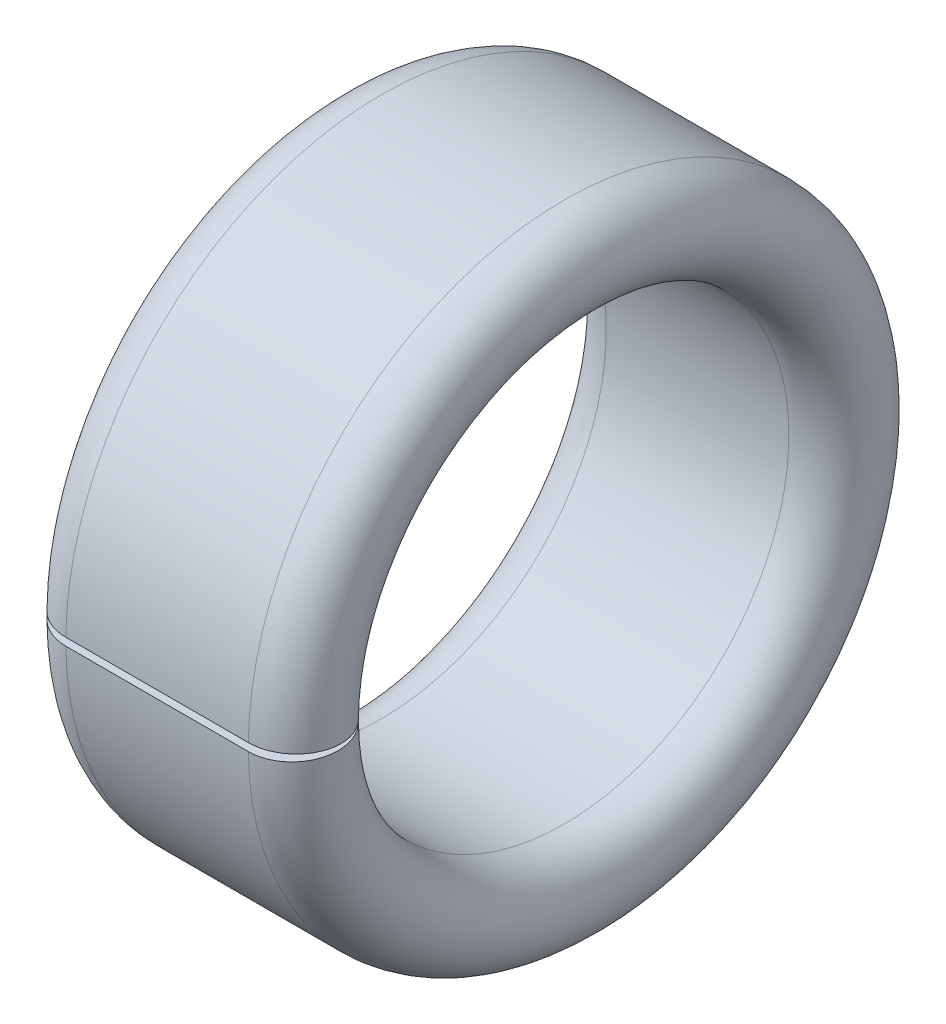
ISO-10303-21;
HEADER;
FILE_DESCRIPTION(('STEP AP214'),'2;1');
FILE_NAME('part.step','',(''),(''),'','','');
FILE_SCHEMA(('AUTOMOTIVE_DESIGN { 1 0 10303 214 1 1 1 1 }'));
ENDSEC;
DATA;
#1=APPLICATION_CONTEXT('core data for automotive mechanical design processes');
#2=APPLICATION_PROTOCOL_DEFINITION('international standard','automotive_design',2000,#1);
#3=PRODUCT_CONTEXT('',#1,'mechanical');
#4=PRODUCT('Part','Part','',(#3));
#5=PRODUCT_RELATED_PRODUCT_CATEGORY('part','',(#4));
#6=PRODUCT_DEFINITION_FORMATION('','',#4);
#7=PRODUCT_DEFINITION_CONTEXT('part definition',#1,'design');
#8=PRODUCT_DEFINITION('design','',#6,#7);
#9=PRODUCT_DEFINITION_SHAPE('','',#8);
#10=(LENGTH_UNIT() NAMED_UNIT(*) SI_UNIT(.MILLI.,.METRE.));
#11=(NAMED_UNIT(*) PLANE_ANGLE_UNIT() SI_UNIT($,.RADIAN.));
#12=(NAMED_UNIT(*) SI_UNIT($,.STERADIAN.) SOLID_ANGLE_UNIT());
#13=UNCERTAINTY_MEASURE_WITH_UNIT(LENGTH_MEASURE(1.E-05),#10,'distance_accuracy_value','');
#14=(GEOMETRIC_REPRESENTATION_CONTEXT(3) GLOBAL_UNCERTAINTY_ASSIGNED_CONTEXT((#13)) GLOBAL_UNIT_ASSIGNED_CONTEXT((#10,
#11,#12)) REPRESENTATION_CONTEXT('',''));
#15=CARTESIAN_POINT('',(0.,0.,0.));
#16=DIRECTION('',(0.,0.,1.));
#17=DIRECTION('',(1.,0.,0.));
#18=AXIS2_PLACEMENT_3D('',#15,#16,#17);
#19=CARTESIAN_POINT('',(0.65,0.,0.));
#20=DIRECTION('',(1.,0.,0.));
#21=DIRECTION('',(0.,0.,-1.));
#22=AXIS2_PLACEMENT_3D('',#19,#20,#21);
#23=TOROIDAL_SURFACE('',#22,3.85,0.65);
#24=CARTESIAN_POINT('',(0.65,0.,0.));
#25=DIRECTION('',(1.,0.,0.));
#26=DIRECTION('',(0.,0.,-1.));
#27=AXIS2_PLACEMENT_3D('',#24,#25,#26);
#28=CIRCLE('',#27,4.5);
#29=CARTESIAN_POINT('',(0.65,-0.0553856430950502,4.49965914603973));
#30=VERTEX_POINT('',#29);
#31=CARTESIAN_POINT('',(0.65,0.0553856430950502,4.49965914603973));
#32=VERTEX_POINT('',#31);
#33=EDGE_CURVE('E82',#30,#32,#28,.T.);
#34=ORIENTED_EDGE('',*,*,#33,.F.);
#35=CARTESIAN_POINT('',(0.6502,-0.0553856420209452,4.49965911528138));
#36=CARTESIAN_POINT('',(0.613640162422909,-0.055387119586004,4.49970142720865));
#37=CARTESIAN_POINT('',(0.577088677921126,-0.0552788167418289,4.49660003953159));
#38=CARTESIAN_POINT('',(0.505044103708183,-0.0548506355577275,4.48433853469269));
#39=CARTESIAN_POINT('',(0.469550252791472,-0.0545309134232436,4.47518289066945));
#40=CARTESIAN_POINT('',(0.400589747790562,-0.0536876631780832,4.45103536306816));
#41=CARTESIAN_POINT('',(0.36712403798953,-0.0531640409632323,4.43604078469912));
#42=CARTESIAN_POINT('',(0.303192172996343,-0.0519283420886692,4.40065499874572));
#43=CARTESIAN_POINT('',(0.272725435014397,-0.0512163021437378,4.38026484253511));
#44=CARTESIAN_POINT('',(0.215644954925809,-0.0496237529747948,4.33466020116776));
#45=CARTESIAN_POINT('',(0.189031692847762,-0.0487432227935688,4.30944511587492));
#46=CARTESIAN_POINT('',(0.140413351325206,-0.0468386332505849,4.25490480732204));
#47=CARTESIAN_POINT('',(0.118408978325227,-0.0458145519255916,4.22557895511723));
#48=CARTESIAN_POINT('',(0.0796332498518353,-0.0436518112032507,4.163646164007));
#49=CARTESIAN_POINT('',(0.0628629529253525,-0.0425131286902977,4.13103856315725));
#50=CARTESIAN_POINT('',(0.0350373536832326,-0.0401537606051438,4.06347510108316));
#51=CARTESIAN_POINT('',(0.0239816948781159,-0.0389330801534921,4.02851938649216));
#52=CARTESIAN_POINT('',(0.00789410530251395,-0.0364438974722856,3.95723852076568));
#53=CARTESIAN_POINT('',(0.00286403596881808,-0.0351753805897738,3.92091295002442));
#54=CARTESIAN_POINT('',(-0.0010240699316397,-0.0326268483335054,3.84793253483424));
#55=CARTESIAN_POINT('',(0.00011804505937394,-0.0313468326781673,3.81127768232188));
#56=CARTESIAN_POINT('',(0.0085428583780061,-0.0288113739353882,3.73867164357527));
#57=CARTESIAN_POINT('',(0.0158268848957219,-0.0275559362230247,3.70272061126311));
#58=CARTESIAN_POINT('',(0.036330574452303,-0.0251055569656707,3.63255093021031));
#59=CARTESIAN_POINT('',(0.0495502222199795,-0.0239106152650446,3.59833227701287));
#60=CARTESIAN_POINT('',(0.0815514669750036,-0.0216150695499982,3.53259644849429));
#61=CARTESIAN_POINT('',(0.100333448905885,-0.0205144720715067,3.50107946033767));
#62=CARTESIAN_POINT('',(0.142925512580246,-0.0184390296690061,3.44164656602556));
#63=CARTESIAN_POINT('',(0.166735344911612,-0.0174641785110735,3.41373048135385));
#64=CARTESIAN_POINT('',(0.218698906057042,-0.0156681959742428,3.36230027053748));
#65=CARTESIAN_POINT('',(0.246851104971362,-0.0148470106805369,3.33878460047471));
#66=CARTESIAN_POINT('',(0.306717436336067,-0.0133810770953265,3.29680575503269));
#67=CARTESIAN_POINT('',(0.338432684757236,-0.0127363843009517,3.2783441688833));
#68=CARTESIAN_POINT('',(0.40451944461703,-0.0116419952832396,3.24700496778206));
#69=CARTESIAN_POINT('',(0.438891433380063,-0.0111923341967547,3.23412835901801));
#70=CARTESIAN_POINT('',(0.50926858003697,-0.0105017485769737,3.21435257429642));
#71=CARTESIAN_POINT('',(0.545271158047522,-0.0102605056490644,3.2074442807101));
#72=CARTESIAN_POINT('',(0.604376485711192,-0.0100416917430007,3.20117827027423));
#73=CARTESIAN_POINT('',(0.627294426364059,-0.00999941069339538,3.19996749942867));
#74=CARTESIAN_POINT('',(0.6502,-0.0100000010743731,3.19998440572788));
#75=B_SPLINE_CURVE_WITH_KNOTS('',3,(#35,#36,#37,#38,#39,#40,#41,#42,#43,#44,#45,#46,#47,#48,#49,
#50,#51,#52,#53,#54,#55,#56,#57,#58,#59,#60,#61,#62,#63,#64,#65,#66,#67,#68,#69,#70,#71,#72,#73,
#74),.UNSPECIFIED.,.F.,.F.,(4,2,2,2,2,2,2,2,2,2,2,2,2,2,2,2,2,2,2,4),(0.,0.109533761042633,
0.218986684234871,0.328490182237423,0.437972358254189,0.547468160785272,0.656980734428369,
0.766515441718591,0.876043315210432,0.985605015547004,1.09516940617961,1.20475749622082,
1.31434530431498,1.42394069824968,1.53353065685953,1.6430820926293,1.75266793680262,
1.86227351573547,1.97171135568883,2.0404275689759),.UNSPECIFIED.);
#76=CARTESIAN_POINT('',(0.65,-0.00999999999999988,3.19998437496185));
#77=VERTEX_POINT('',#76);
#78=EDGE_CURVE('E61',#30,#77,#75,.T.);
#79=ORIENTED_EDGE('',*,*,#78,.T.);
#80=CARTESIAN_POINT('',(0.65,0.,0.));
#81=DIRECTION('',(1.,0.,0.));
#82=DIRECTION('',(0.,0.,-1.));
#83=AXIS2_PLACEMENT_3D('',#80,#81,#82);
#84=CIRCLE('',#83,3.2);
#85=CARTESIAN_POINT('',(0.65,0.00999999999999986,3.19998437496185));
#86=VERTEX_POINT('',#85);
#87=EDGE_CURVE('E84',#77,#86,#84,.T.);
#88=ORIENTED_EDGE('',*,*,#87,.T.);
#89=CARTESIAN_POINT('',(0.6502,0.0100000010743731,3.19998440572788));
#90=CARTESIAN_POINT('',(0.613645692930617,0.00999852146235721,3.19994203518343));
#91=CARTESIAN_POINT('',(0.577099820827778,0.01010682043665,3.20304331204156));
#92=CARTESIAN_POINT('',(0.505066791390805,0.0105349717149683,3.21530396049089));
#93=CARTESIAN_POINT('',(0.469578863077438,0.010854665820221,3.22445880186196));
#94=CARTESIAN_POINT('',(0.400630084367355,0.0116978180757726,3.24860352340799));
#95=CARTESIAN_POINT('',(0.367170170668221,0.0122213695670951,3.26359607652015));
#96=CARTESIAN_POINT('',(0.303248870077235,0.0134568665655181,3.29897608149728));
#97=CARTESIAN_POINT('',(0.272786909859248,0.0141687759547852,3.31936249908281));
#98=CARTESIAN_POINT('',(0.215709968981946,0.0157611099980182,3.36496098005584));
#99=CARTESIAN_POINT('',(0.189096029403005,0.0166415801068325,3.39017434509989));
#100=CARTESIAN_POINT('',(0.140474944579481,0.0185460249204647,3.44471050914639));
#101=CARTESIAN_POINT('',(0.118468509232525,0.0195700216985263,3.47403394024385));
#102=CARTESIAN_POINT('',(0.0796827843469036,0.0217328066067737,3.5359679966729));
#103=CARTESIAN_POINT('',(0.0629056429049683,0.02287164165682,3.56857996561348));
#104=CARTESIAN_POINT('',(0.0350669831524344,0.0252313513806475,3.63615321093917));
#105=CARTESIAN_POINT('',(0.024005110723114,0.0264522209662614,3.67111434161821));
#106=CARTESIAN_POINT('',(0.00790613882833748,0.0289418502069074,3.74240799513391));
#107=CARTESIAN_POINT('',(0.00287105593037289,0.0302106257449016,3.77874097279908));
#108=CARTESIAN_POINT('',(-0.00102464317487148,0.0327597003051775,3.85173691754417));
#109=CARTESIAN_POINT('',(0.000114886627742614,0.0340399995992446,3.88839989240702));
#110=CARTESIAN_POINT('',(0.00853701899218194,0.036575806461535,3.96101589999212));
#111=CARTESIAN_POINT('',(0.0158198941740041,0.0378313129270095,3.99696890113578));
#112=CARTESIAN_POINT('',(0.0363229468121633,0.040281817447814,4.06714216926447));
#113=CARTESIAN_POINT('',(0.0495431008473879,0.0414768157418133,4.10136244308409));
#114=CARTESIAN_POINT('',(0.08154372960915,0.0437721957509364,4.16709352640588));
#115=CARTESIAN_POINT('',(0.100323411337856,0.0448725909311577,4.198604721498));
#116=CARTESIAN_POINT('',(0.142910252219497,0.0469476346621698,4.25802619935238));
#117=CARTESIAN_POINT('',(0.166717159172307,0.0479222895170085,4.28593666263897));
#118=CARTESIAN_POINT('',(0.218672408948953,0.0497178429356373,4.33735458511783));
#119=CARTESIAN_POINT('',(0.246818960159905,0.0505388046430055,4.3608638525056));
#120=CARTESIAN_POINT('',(0.306672475946114,0.0520043565785012,4.40283176892972));
#121=CARTESIAN_POINT('',(0.338380557845351,0.052648891238724,4.42128882670948));
#122=CARTESIAN_POINT('',(0.40445673468139,0.0537431490659153,4.45262427100574));
#123=CARTESIAN_POINT('',(0.438825711104159,0.0541928073470635,4.46550079943546));
#124=CARTESIAN_POINT('',(0.509196611815403,0.0548834587393044,4.48527846763387));
#125=CARTESIAN_POINT('',(0.545195961881649,0.0551247695018203,4.49218870374917));
#126=CARTESIAN_POINT('',(0.60432410085322,0.0553438654646084,4.49846279123284));
#127=CARTESIAN_POINT('',(0.627268237460093,0.0553862326845504,4.49967602967399));
#128=CARTESIAN_POINT('',(0.6502,0.0553856420209452,4.49965911528138));
#129=B_SPLINE_CURVE_WITH_KNOTS('',3,(#89,#90,#91,#92,#93,#94,#95,#96,#97,#98,#99,#100,#101,#102,
#103,#104,#105,#106,#107,#108,#109,#110,#111,#112,#113,#114,#115,#116,#117,#118,#119,#120,#121,
#122,#123,#124,#125,#126,#127,#128),.UNSPECIFIED.,.F.,.F.,(4,2,2,2,2,2,2,2,2,2,2,2,2,2,2,2,2,2,
2,4),(0.,0.109517026054359,0.218952187021615,0.328437514552594,0.437901863347839,
0.547395772481673,0.656906539409793,0.766462232219083,0.876011136130819,0.985596684935812,
1.09518482510077,1.20477782865667,1.31437039989879,1.42394734664235,1.5335187975595,
1.64304513267076,1.75260592488111,1.8622031683562,1.97163302078793,2.04042771381992),.UNSPECIFIED.);
#130=EDGE_CURVE('E80',#86,#32,#129,.T.);
#131=ORIENTED_EDGE('',*,*,#130,.T.);
#132=EDGE_LOOP('',(#34,#79,#88,#131));
#133=FACE_BOUND('',#132,.T.);
#134=ADVANCED_FACE('F38',(#133),#23,.T.);
#135=CARTESIAN_POINT('',(3.9,0.,0.));
#136=DIRECTION('',(1.,0.,0.));
#137=DIRECTION('',(0.,0.,-1.));
#138=AXIS2_PLACEMENT_3D('',#135,#136,#137);
#139=CYLINDRICAL_SURFACE('',#138,3.2);
#140=ORIENTED_EDGE('',*,*,#87,.F.);
#141=DIRECTION('',(1.,0.,0.));
#142=VECTOR('',#141,1.);
#143=CARTESIAN_POINT('',(3.9,-0.00999999999999988,3.19998437496185));
#144=LINE('',#143,#142);
#145=CARTESIAN_POINT('',(3.25,-0.00999999999999986,3.19998437496185));
#146=VERTEX_POINT('',#145);
#147=EDGE_CURVE('E96',#77,#146,#144,.T.);
#148=ORIENTED_EDGE('',*,*,#147,.T.);
#149=CARTESIAN_POINT('',(3.25,0.,0.));
#150=DIRECTION('',(1.,0.,0.));
#151=DIRECTION('',(0.,0.,-1.));
#152=AXIS2_PLACEMENT_3D('',#149,#150,#151);
#153=CIRCLE('',#152,3.2);
#154=CARTESIAN_POINT('',(3.25,0.00999999999999986,3.19998437496185));
#155=VERTEX_POINT('',#154);
#156=EDGE_CURVE('E94',#146,#155,#153,.T.);
#157=ORIENTED_EDGE('',*,*,#156,.T.);
#158=DIRECTION('',(1.,0.,0.));
#159=VECTOR('',#158,1.);
#160=CARTESIAN_POINT('',(3.9,0.00999999999999988,3.19998437496185));
#161=LINE('',#160,#159);
#162=EDGE_CURVE('E111',#155,#86,#161,.F.);
#163=ORIENTED_EDGE('',*,*,#162,.T.);
#164=EDGE_LOOP('',(#140,#148,#157,#163));
#165=FACE_BOUND('',#164,.T.);
#166=ADVANCED_FACE('F110',(#165),#139,.F.);
#167=CARTESIAN_POINT('',(3.9,0.,0.));
#168=DIRECTION('',(1.,0.,0.));
#169=DIRECTION('',(0.,0.,-1.));
#170=AXIS2_PLACEMENT_3D('',#167,#168,#169);
#171=CYLINDRICAL_SURFACE('',#170,4.5);
#172=CARTESIAN_POINT('',(3.25,0.,0.));
#173=DIRECTION('',(1.,0.,0.));
#174=DIRECTION('',(0.,0.,-1.));
#175=AXIS2_PLACEMENT_3D('',#172,#173,#174);
#176=CIRCLE('',#175,4.5);
#177=CARTESIAN_POINT('',(3.25,-0.0553856430950502,4.49965914603973));
#178=VERTEX_POINT('',#177);
#179=CARTESIAN_POINT('',(3.25,0.0553856430950502,4.49965914603973));
#180=VERTEX_POINT('',#179);
#181=EDGE_CURVE('E92',#178,#180,#176,.T.);
#182=ORIENTED_EDGE('',*,*,#181,.F.);
#183=DIRECTION('',(1.,0.,0.));
#184=VECTOR('',#183,1.);
#185=CARTESIAN_POINT('',(3.9,-0.0553856430950502,4.49965914603973));
#186=LINE('',#185,#184);
#187=EDGE_CURVE('E11',#178,#30,#186,.F.);
#188=ORIENTED_EDGE('',*,*,#187,.T.);
#189=ORIENTED_EDGE('',*,*,#33,.T.);
#190=DIRECTION('',(1.,0.,0.));
#191=VECTOR('',#190,1.);
#192=CARTESIAN_POINT('',(3.9,0.0553856430950502,4.49965914603973));
#193=LINE('',#192,#191);
#194=EDGE_CURVE('E46',#32,#180,#193,.T.);
#195=ORIENTED_EDGE('',*,*,#194,.T.);
#196=EDGE_LOOP('',(#182,#188,#189,#195));
#197=FACE_BOUND('',#196,.T.);
#198=ADVANCED_FACE('F91',(#197),#171,.T.);
#199=CARTESIAN_POINT('',(3.25,0.,0.));
#200=DIRECTION('',(1.,0.,0.));
#201=DIRECTION('',(0.,0.,-1.));
#202=AXIS2_PLACEMENT_3D('',#199,#200,#201);
#203=TOROIDAL_SURFACE('',#202,3.85,0.65);
#204=ORIENTED_EDGE('',*,*,#156,.F.);
#205=CARTESIAN_POINT('',(3.2498,-0.0100000010743731,3.19998440572788));
#206=CARTESIAN_POINT('',(3.28635430706938,-0.00999852146235719,3.19994203518343));
#207=CARTESIAN_POINT('',(3.32290017917222,-0.01010682043665,3.20304331204156));
#208=CARTESIAN_POINT('',(3.39493320860919,-0.0105349717149683,3.21530396049089));
#209=CARTESIAN_POINT('',(3.43042113692256,-0.010854665820221,3.22445880186196));
#210=CARTESIAN_POINT('',(3.49936991563265,-0.0116978180757726,3.24860352340799));
#211=CARTESIAN_POINT('',(3.53282982933178,-0.0122213695670951,3.26359607652015));
#212=CARTESIAN_POINT('',(3.59675112992276,-0.0134568665655181,3.29897608149728));
#213=CARTESIAN_POINT('',(3.62721309014075,-0.0141687759547851,3.31936249908281));
#214=CARTESIAN_POINT('',(3.68429003101805,-0.0157611099980182,3.36496098005584));
#215=CARTESIAN_POINT('',(3.710903970597,-0.0166415801068325,3.39017434509989));
#216=CARTESIAN_POINT('',(3.75952505542052,-0.0185460249204646,3.44471050914639));
#217=CARTESIAN_POINT('',(3.78153149076747,-0.0195700216985263,3.47403394024385));
#218=CARTESIAN_POINT('',(3.8203172156531,-0.0217328066067737,3.5359679966729));
#219=CARTESIAN_POINT('',(3.83709435709503,-0.02287164165682,3.56857996561348));
#220=CARTESIAN_POINT('',(3.86493301684757,-0.0252313513806475,3.63615321093917));
#221=CARTESIAN_POINT('',(3.87599488927689,-0.0264522209662614,3.67111434161821));
#222=CARTESIAN_POINT('',(3.89209386117166,-0.0289418502069074,3.74240799513391));
#223=CARTESIAN_POINT('',(3.89712894406963,-0.0302106257449016,3.77874097279908));
#224=CARTESIAN_POINT('',(3.90102464317487,-0.0327597003051775,3.85173691754417));
#225=CARTESIAN_POINT('',(3.89988511337226,-0.0340399995992447,3.88839989240702));
#226=CARTESIAN_POINT('',(3.89146298100782,-0.036575806461535,3.96101589999212));
#227=CARTESIAN_POINT('',(3.884180105826,-0.0378313129270095,3.99696890113579));
#228=CARTESIAN_POINT('',(3.86367705318784,-0.040281817447814,4.06714216926447));
#229=CARTESIAN_POINT('',(3.85045689915261,-0.0414768157418133,4.10136244308409));
#230=CARTESIAN_POINT('',(3.81845627039085,-0.0437721957509364,4.16709352640588));
#231=CARTESIAN_POINT('',(3.79967658866214,-0.0448725909311577,4.198604721498));
#232=CARTESIAN_POINT('',(3.7570897477805,-0.0469476346621698,4.25802619935238));
#233=CARTESIAN_POINT('',(3.73328284082769,-0.0479222895170084,4.28593666263897));
#234=CARTESIAN_POINT('',(3.68132759105105,-0.0497178429356373,4.33735458511783));
#235=CARTESIAN_POINT('',(3.65318103984009,-0.0505388046430055,4.3608638525056));
#236=CARTESIAN_POINT('',(3.59332752405389,-0.0520043565785012,4.40283176892972));
#237=CARTESIAN_POINT('',(3.56161944215465,-0.052648891238724,4.42128882670948));
#238=CARTESIAN_POINT('',(3.49554326531861,-0.0537431490659153,4.45262427100574));
#239=CARTESIAN_POINT('',(3.46117428889584,-0.0541928073470635,4.46550079943546));
#240=CARTESIAN_POINT('',(3.3908033881846,-0.0548834587393044,4.48527846763387));
#241=CARTESIAN_POINT('',(3.35480403811835,-0.0551247695018203,4.49218870374917));
#242=CARTESIAN_POINT('',(3.29567589914678,-0.0553438654646084,4.49846279123284));
#243=CARTESIAN_POINT('',(3.27273176253991,-0.0553862326845504,4.49967602967399));
#244=CARTESIAN_POINT('',(3.2498,-0.0553856420209452,4.49965911528138));
#245=B_SPLINE_CURVE_WITH_KNOTS('',3,(#205,#206,#207,#208,#209,#210,#211,#212,#213,#214,#215,
#216,#217,#218,#219,#220,#221,#222,#223,#224,#225,#226,#227,#228,#229,#230,#231,#232,#233,#234,
#235,#236,#237,#238,#239,#240,#241,#242,#243,#244),.UNSPECIFIED.,.F.,.F.,(4,2,2,2,2,2,2,2,2,2,2,
2,2,2,2,2,2,2,2,4),(0.,0.109517026054359,0.218952187021615,0.328437514552593,0.437901863347839,
0.547395772481673,0.656906539409793,0.766462232219082,0.87601113613082,0.985596684935813,
1.09518482510077,1.20477782865667,1.31437039989879,1.42394734664235,1.5335187975595,
1.64304513267076,1.75260592488111,1.8622031683562,1.97163302078793,2.04042771381991),.UNSPECIFIED.);
#246=EDGE_CURVE('E114',#146,#178,#245,.T.);
#247=ORIENTED_EDGE('',*,*,#246,.T.);
#248=ORIENTED_EDGE('',*,*,#181,.T.);
#249=CARTESIAN_POINT('',(3.2498,0.0553856420209452,4.49965911528138));
#250=CARTESIAN_POINT('',(3.28635983757709,0.055387119586004,4.49970142720865));
#251=CARTESIAN_POINT('',(3.32291132207887,0.0552788167418289,4.49660003953159));
#252=CARTESIAN_POINT('',(3.39495589629182,0.0548506355577275,4.48433853469268));
#253=CARTESIAN_POINT('',(3.43044974720853,0.0545309134232436,4.47518289066945));
#254=CARTESIAN_POINT('',(3.49941025220944,0.0536876631780832,4.45103536306815));
#255=CARTESIAN_POINT('',(3.53287596201047,0.0531640409632323,4.43604078469912));
#256=CARTESIAN_POINT('',(3.59680782700366,0.0519283420886692,4.40065499874572));
#257=CARTESIAN_POINT('',(3.6272745649856,0.0512163021437378,4.38026484253511));
#258=CARTESIAN_POINT('',(3.68435504507419,0.0496237529747948,4.33466020116776));
#259=CARTESIAN_POINT('',(3.71096830715224,0.0487432227935688,4.30944511587492));
#260=CARTESIAN_POINT('',(3.75958664867479,0.0468386332505849,4.25490480732204));
#261=CARTESIAN_POINT('',(3.78159102167477,0.0458145519255915,4.22557895511723));
#262=CARTESIAN_POINT('',(3.82036675014816,0.0436518112032507,4.163646164007));
#263=CARTESIAN_POINT('',(3.83713704707465,0.0425131286902977,4.13103856315725));
#264=CARTESIAN_POINT('',(3.86496264631677,0.0401537606051438,4.06347510108316));
#265=CARTESIAN_POINT('',(3.87601830512188,0.0389330801534921,4.02851938649216));
#266=CARTESIAN_POINT('',(3.89210589469749,0.0364438974722856,3.95723852076568));
#267=CARTESIAN_POINT('',(3.89713596403118,0.0351753805897738,3.92091295002442));
#268=CARTESIAN_POINT('',(3.90102406993164,0.0326268483335054,3.84793253483423));
#269=CARTESIAN_POINT('',(3.89988195494063,0.0313468326781673,3.81127768232188));
#270=CARTESIAN_POINT('',(3.89145714162199,0.0288113739353881,3.73867164357527));
#271=CARTESIAN_POINT('',(3.88417311510428,0.0275559362230247,3.7027206112631));
#272=CARTESIAN_POINT('',(3.8636694255477,0.0251055569656706,3.63255093021031));
#273=CARTESIAN_POINT('',(3.85044977778002,0.0239106152650446,3.59833227701287));
#274=CARTESIAN_POINT('',(3.818448533025,0.0216150695499982,3.53259644849429));
#275=CARTESIAN_POINT('',(3.79966655109411,0.0205144720715067,3.50107946033766));
#276=CARTESIAN_POINT('',(3.75707448741975,0.0184390296690061,3.44164656602555));
#277=CARTESIAN_POINT('',(3.73326465508839,0.0174641785110735,3.41373048135385));
#278=CARTESIAN_POINT('',(3.68130109394296,0.0156681959742427,3.36230027053747));
#279=CARTESIAN_POINT('',(3.65314889502864,0.0148470106805368,3.33878460047471));
#280=CARTESIAN_POINT('',(3.59328256366393,0.0133810770953265,3.29680575503269));
#281=CARTESIAN_POINT('',(3.56156731524276,0.0127363843009517,3.2783441688833));
#282=CARTESIAN_POINT('',(3.49548055538297,0.0116419952832396,3.24700496778206));
#283=CARTESIAN_POINT('',(3.46110856661994,0.0111923341967547,3.23412835901801));
#284=CARTESIAN_POINT('',(3.39073141996303,0.0105017485769737,3.21435257429642));
#285=CARTESIAN_POINT('',(3.35472884195248,0.0102605056490644,3.2074442807101));
#286=CARTESIAN_POINT('',(3.29562351428881,0.0100416917430007,3.20117827027423));
#287=CARTESIAN_POINT('',(3.27270557363594,0.00999941069339539,3.19996749942867));
#288=CARTESIAN_POINT('',(3.2498,0.0100000010743731,3.19998440572788));
#289=B_SPLINE_CURVE_WITH_KNOTS('',3,(#249,#250,#251,#252,#253,#254,#255,#256,#257,#258,#259,
#260,#261,#262,#263,#264,#265,#266,#267,#268,#269,#270,#271,#272,#273,#274,#275,#276,#277,#278,
#279,#280,#281,#282,#283,#284,#285,#286,#287,#288),.UNSPECIFIED.,.F.,.F.,(4,2,2,2,2,2,2,2,2,2,2,
2,2,2,2,2,2,2,2,4),(0.,0.109533761042633,0.218986684234872,0.328490182237423,0.437972358254189,
0.547468160785273,0.65698073442837,0.766515441718591,0.876043315210432,0.985605015547004,
1.09516940617961,1.20475749622082,1.31434530431498,1.42394069824968,1.53353065685953,
1.6430820926293,1.75266793680262,1.86227351573547,1.97171135568883,2.0404275689759),.UNSPECIFIED.);
#290=EDGE_CURVE('E53',#180,#155,#289,.T.);
#291=ORIENTED_EDGE('',*,*,#290,.T.);
#292=EDGE_LOOP('',(#204,#247,#248,#291));
#293=FACE_BOUND('',#292,.T.);
#294=ADVANCED_FACE('F113',(#293),#203,.T.);
#295=CARTESIAN_POINT('',(3.9,0.,2.9136218421327));
#296=DIRECTION('',(0.,-0.999390827019096,0.0348994967025009));
#297=DIRECTION('',(0.,-0.0348994967025009,-0.999390827019096));
#298=AXIS2_PLACEMENT_3D('',#295,#296,#297);
#299=PLANE('',#298);
#300=ORIENTED_EDGE('',*,*,#290,.F.);
#301=ORIENTED_EDGE('',*,*,#194,.F.);
#302=ORIENTED_EDGE('',*,*,#130,.F.);
#303=ORIENTED_EDGE('',*,*,#162,.F.);
#304=EDGE_LOOP('',(#300,#301,#302,#303));
#305=FACE_BOUND('',#304,.T.);
#306=ADVANCED_FACE('F87',(#305),#299,.T.);
#307=CARTESIAN_POINT('',(3.9,-0.090292431964369,5.4992587933948));
#308=DIRECTION('',(0.,0.999390827019096,0.0348994967025009));
#309=DIRECTION('',(0.,-0.0348994967025009,0.999390827019096));
#310=AXIS2_PLACEMENT_3D('',#307,#308,#309);
#311=PLANE('',#310);
#312=ORIENTED_EDGE('',*,*,#187,.F.);
#313=ORIENTED_EDGE('',*,*,#246,.F.);
#314=ORIENTED_EDGE('',*,*,#147,.F.);
#315=ORIENTED_EDGE('',*,*,#78,.F.);
#316=EDGE_LOOP('',(#312,#313,#314,#315));
#317=FACE_BOUND('',#316,.T.);
#318=ADVANCED_FACE('F131',(#317),#311,.T.);
#319=CLOSED_SHELL('',(#134,#166,#198,#294,#306,#318));
#320=MANIFOLD_SOLID_BREP('B2',#319);
#321=ADVANCED_BREP_SHAPE_REPRESENTATION('',(#18,#320),#14);
#322=SHAPE_DEFINITION_REPRESENTATION(#9,#321);
ENDSEC;
END-ISO-10303-21;
